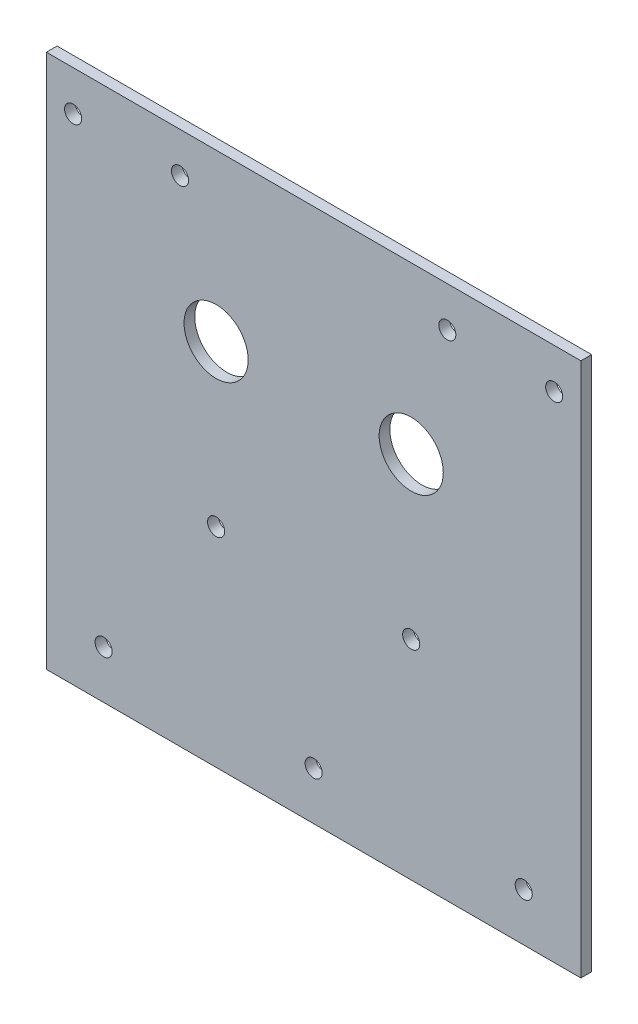
ISO-10303-21;
HEADER;
FILE_DESCRIPTION(('STEP AP214'),'2;1');
FILE_NAME('part.step','',(''),(''),'','','');
FILE_SCHEMA(('AUTOMOTIVE_DESIGN { 1 0 10303 214 1 1 1 1 }'));
ENDSEC;
DATA;
#1=APPLICATION_CONTEXT('core data for automotive mechanical design processes');
#2=APPLICATION_PROTOCOL_DEFINITION('international standard','automotive_design',2000,#1);
#3=PRODUCT_CONTEXT('',#1,'mechanical');
#4=PRODUCT('Part','Part','',(#3));
#5=PRODUCT_RELATED_PRODUCT_CATEGORY('part','',(#4));
#6=PRODUCT_DEFINITION_FORMATION('','',#4);
#7=PRODUCT_DEFINITION_CONTEXT('part definition',#1,'design');
#8=PRODUCT_DEFINITION('design','',#6,#7);
#9=PRODUCT_DEFINITION_SHAPE('','',#8);
#10=(LENGTH_UNIT() NAMED_UNIT(*) SI_UNIT(.MILLI.,.METRE.));
#11=(NAMED_UNIT(*) PLANE_ANGLE_UNIT() SI_UNIT($,.RADIAN.));
#12=(NAMED_UNIT(*) SI_UNIT($,.STERADIAN.) SOLID_ANGLE_UNIT());
#13=UNCERTAINTY_MEASURE_WITH_UNIT(LENGTH_MEASURE(1.E-05),#10,'distance_accuracy_value','');
#14=(GEOMETRIC_REPRESENTATION_CONTEXT(3) GLOBAL_UNCERTAINTY_ASSIGNED_CONTEXT((#13)) GLOBAL_UNIT_ASSIGNED_CONTEXT((#10,
#11,#12)) REPRESENTATION_CONTEXT('',''));
#15=CARTESIAN_POINT('',(0.,0.,0.));
#16=DIRECTION('',(0.,0.,1.));
#17=DIRECTION('',(1.,0.,0.));
#18=AXIS2_PLACEMENT_3D('',#15,#16,#17);
#19=CARTESIAN_POINT('',(50.,50.,2.));
#20=DIRECTION('',(-1.,0.,0.));
#21=DIRECTION('',(0.,-1.,0.));
#22=AXIS2_PLACEMENT_3D('',#19,#20,#21);
#23=PLANE('',#22);
#24=DIRECTION('',(0.,1.,0.));
#25=VECTOR('',#24,1.);
#26=CARTESIAN_POINT('',(50.,50.,0.));
#27=LINE('',#26,#25);
#28=CARTESIAN_POINT('',(50.,-50.,0.));
#29=VERTEX_POINT('',#28);
#30=CARTESIAN_POINT('',(50.,50.,0.));
#31=VERTEX_POINT('',#30);
#32=EDGE_CURVE('E101',#29,#31,#27,.T.);
#33=ORIENTED_EDGE('',*,*,#32,.T.);
#34=DIRECTION('',(0.,0.,-1.));
#35=VECTOR('',#34,1.);
#36=CARTESIAN_POINT('',(50.,50.,2.));
#37=LINE('',#36,#35);
#38=CARTESIAN_POINT('',(50.,50.,2.));
#39=VERTEX_POINT('',#38);
#40=EDGE_CURVE('E11',#39,#31,#37,.T.);
#41=ORIENTED_EDGE('',*,*,#40,.F.);
#42=DIRECTION('',(0.,1.,0.));
#43=VECTOR('',#42,1.);
#44=CARTESIAN_POINT('',(50.,50.,2.));
#45=LINE('',#44,#43);
#46=CARTESIAN_POINT('',(50.,-50.,2.));
#47=VERTEX_POINT('',#46);
#48=EDGE_CURVE('E88',#47,#39,#45,.T.);
#49=ORIENTED_EDGE('',*,*,#48,.F.);
#50=DIRECTION('',(0.,0.,-1.));
#51=VECTOR('',#50,1.);
#52=CARTESIAN_POINT('',(50.,-50.,2.));
#53=LINE('',#52,#51);
#54=EDGE_CURVE('E97',#47,#29,#53,.T.);
#55=ORIENTED_EDGE('',*,*,#54,.T.);
#56=EDGE_LOOP('',(#33,#41,#49,#55));
#57=FACE_BOUND('',#56,.T.);
#58=ADVANCED_FACE('F35',(#57),#23,.F.);
#59=CARTESIAN_POINT('',(-50.,50.,2.));
#60=DIRECTION('',(0.,-1.,0.));
#61=DIRECTION('',(0.,0.,-1.));
#62=AXIS2_PLACEMENT_3D('',#59,#60,#61);
#63=PLANE('',#62);
#64=DIRECTION('',(-1.,0.,0.));
#65=VECTOR('',#64,1.);
#66=CARTESIAN_POINT('',(-50.,50.,0.));
#67=LINE('',#66,#65);
#68=CARTESIAN_POINT('',(-50.,50.,0.));
#69=VERTEX_POINT('',#68);
#70=EDGE_CURVE('E92',#31,#69,#67,.T.);
#71=ORIENTED_EDGE('',*,*,#70,.T.);
#72=DIRECTION('',(0.,0.,-1.));
#73=VECTOR('',#72,1.);
#74=CARTESIAN_POINT('',(-50.,50.,2.));
#75=LINE('',#74,#73);
#76=CARTESIAN_POINT('',(-50.,50.,2.));
#77=VERTEX_POINT('',#76);
#78=EDGE_CURVE('E44',#77,#69,#75,.T.);
#79=ORIENTED_EDGE('',*,*,#78,.F.);
#80=DIRECTION('',(-1.,0.,0.));
#81=VECTOR('',#80,1.);
#82=CARTESIAN_POINT('',(-50.,50.,2.));
#83=LINE('',#82,#81);
#84=EDGE_CURVE('E83',#39,#77,#83,.T.);
#85=ORIENTED_EDGE('',*,*,#84,.F.);
#86=ORIENTED_EDGE('',*,*,#40,.T.);
#87=EDGE_LOOP('',(#71,#79,#85,#86));
#88=FACE_BOUND('',#87,.T.);
#89=ADVANCED_FACE('F91',(#88),#63,.F.);
#90=CARTESIAN_POINT('',(-50.,50.,2.));
#91=DIRECTION('',(1.,0.,0.));
#92=DIRECTION('',(0.,1.,0.));
#93=AXIS2_PLACEMENT_3D('',#90,#91,#92);
#94=PLANE('',#93);
#95=DIRECTION('',(0.,-1.,0.));
#96=VECTOR('',#95,1.);
#97=CARTESIAN_POINT('',(-50.,50.,0.));
#98=LINE('',#97,#96);
#99=CARTESIAN_POINT('',(-50.,-50.,0.));
#100=VERTEX_POINT('',#99);
#101=EDGE_CURVE('E70',#69,#100,#98,.T.);
#102=ORIENTED_EDGE('',*,*,#101,.T.);
#103=DIRECTION('',(0.,0.,-1.));
#104=VECTOR('',#103,1.);
#105=CARTESIAN_POINT('',(-50.,-50.,2.));
#106=LINE('',#105,#104);
#107=CARTESIAN_POINT('',(-50.,-50.,2.));
#108=VERTEX_POINT('',#107);
#109=EDGE_CURVE('E93',#108,#100,#106,.T.);
#110=ORIENTED_EDGE('',*,*,#109,.F.);
#111=DIRECTION('',(0.,-1.,0.));
#112=VECTOR('',#111,1.);
#113=CARTESIAN_POINT('',(-50.,50.,2.));
#114=LINE('',#113,#112);
#115=EDGE_CURVE('E86',#77,#108,#114,.T.);
#116=ORIENTED_EDGE('',*,*,#115,.F.);
#117=ORIENTED_EDGE('',*,*,#78,.T.);
#118=EDGE_LOOP('',(#102,#110,#116,#117));
#119=FACE_BOUND('',#118,.T.);
#120=ADVANCED_FACE('F95',(#119),#94,.F.);
#121=CARTESIAN_POINT('',(-50.,-50.,2.));
#122=DIRECTION('',(0.,1.,0.));
#123=DIRECTION('',(0.,0.,1.));
#124=AXIS2_PLACEMENT_3D('',#121,#122,#123);
#125=PLANE('',#124);
#126=DIRECTION('',(1.,0.,0.));
#127=VECTOR('',#126,1.);
#128=CARTESIAN_POINT('',(-50.,-50.,0.));
#129=LINE('',#128,#127);
#130=EDGE_CURVE('E76',#100,#29,#129,.T.);
#131=ORIENTED_EDGE('',*,*,#130,.T.);
#132=ORIENTED_EDGE('',*,*,#54,.F.);
#133=DIRECTION('',(1.,0.,0.));
#134=VECTOR('',#133,1.);
#135=CARTESIAN_POINT('',(-50.,-50.,2.));
#136=LINE('',#135,#134);
#137=EDGE_CURVE('E53',#108,#47,#136,.T.);
#138=ORIENTED_EDGE('',*,*,#137,.F.);
#139=ORIENTED_EDGE('',*,*,#109,.T.);
#140=EDGE_LOOP('',(#131,#132,#138,#139));
#141=FACE_BOUND('',#140,.T.);
#142=ADVANCED_FACE('F182',(#141),#125,.F.);
#143=CARTESIAN_POINT('',(0.,0.,2.));
#144=DIRECTION('',(0.,0.,1.));
#145=DIRECTION('',(1.,0.,0.));
#146=AXIS2_PLACEMENT_3D('',#143,#144,#145);
#147=PLANE('',#146);
#148=CARTESIAN_POINT('',(-39.3,-41.,2.));
#149=DIRECTION('',(0.,0.,1.));
#150=DIRECTION('',(1.,0.,0.));
#151=AXIS2_PLACEMENT_3D('',#148,#149,#150);
#152=CIRCLE('',#151,1.6);
#153=CARTESIAN_POINT('',(-37.7,-41.,2.));
#154=VERTEX_POINT('',#153);
#155=EDGE_CURVE('E131',#154,#154,#152,.T.);
#156=ORIENTED_EDGE('',*,*,#155,.F.);
#157=EDGE_LOOP('',(#156));
#158=FACE_BOUND('',#157,.T.);
#159=CARTESIAN_POINT('',(39.3,-41.,2.));
#160=DIRECTION('',(0.,0.,1.));
#161=DIRECTION('',(1.,0.,0.));
#162=AXIS2_PLACEMENT_3D('',#159,#160,#161);
#163=CIRCLE('',#162,1.6);
#164=CARTESIAN_POINT('',(40.9,-41.,2.));
#165=VERTEX_POINT('',#164);
#166=EDGE_CURVE('E137',#165,#165,#163,.T.);
#167=ORIENTED_EDGE('',*,*,#166,.F.);
#168=EDGE_LOOP('',(#167));
#169=FACE_BOUND('',#168,.T.);
#170=CARTESIAN_POINT('',(-18.25,-11.,2.));
#171=DIRECTION('',(0.,0.,1.));
#172=DIRECTION('',(1.,0.,0.));
#173=AXIS2_PLACEMENT_3D('',#170,#171,#172);
#174=CIRCLE('',#173,1.6);
#175=CARTESIAN_POINT('',(-16.65,-11.,2.));
#176=VERTEX_POINT('',#175);
#177=EDGE_CURVE('E126',#176,#176,#174,.T.);
#178=ORIENTED_EDGE('',*,*,#177,.F.);
#179=EDGE_LOOP('',(#178));
#180=FACE_BOUND('',#179,.T.);
#181=CARTESIAN_POINT('',(18.25,-11.,2.));
#182=DIRECTION('',(0.,0.,1.));
#183=DIRECTION('',(1.,0.,0.));
#184=AXIS2_PLACEMENT_3D('',#181,#182,#183);
#185=CIRCLE('',#184,1.6);
#186=CARTESIAN_POINT('',(19.85,-11.,2.));
#187=VERTEX_POINT('',#186);
#188=EDGE_CURVE('E135',#187,#187,#185,.T.);
#189=ORIENTED_EDGE('',*,*,#188,.F.);
#190=EDGE_LOOP('',(#189));
#191=FACE_BOUND('',#190,.T.);
#192=CARTESIAN_POINT('',(-18.25,19.,2.));
#193=DIRECTION('',(0.,0.,1.));
#194=DIRECTION('',(1.,0.,0.));
#195=AXIS2_PLACEMENT_3D('',#192,#193,#194);
#196=CIRCLE('',#195,6.);
#197=CARTESIAN_POINT('',(-12.25,19.,2.));
#198=VERTEX_POINT('',#197);
#199=EDGE_CURVE('E119',#198,#198,#196,.T.);
#200=ORIENTED_EDGE('',*,*,#199,.F.);
#201=EDGE_LOOP('',(#200));
#202=FACE_BOUND('',#201,.T.);
#203=CARTESIAN_POINT('',(18.25,19.,2.));
#204=DIRECTION('',(0.,0.,1.));
#205=DIRECTION('',(1.,0.,0.));
#206=AXIS2_PLACEMENT_3D('',#203,#204,#205);
#207=CIRCLE('',#206,6.);
#208=CARTESIAN_POINT('',(24.25,19.,2.));
#209=VERTEX_POINT('',#208);
#210=EDGE_CURVE('E128',#209,#209,#207,.T.);
#211=ORIENTED_EDGE('',*,*,#210,.F.);
#212=EDGE_LOOP('',(#211));
#213=FACE_BOUND('',#212,.T.);
#214=CARTESIAN_POINT('',(0.,-41.,2.));
#215=DIRECTION('',(0.,0.,1.));
#216=DIRECTION('',(1.,0.,0.));
#217=AXIS2_PLACEMENT_3D('',#214,#215,#216);
#218=CIRCLE('',#217,1.6);
#219=CARTESIAN_POINT('',(1.6,-41.,2.));
#220=VERTEX_POINT('',#219);
#221=EDGE_CURVE('E114',#220,#220,#218,.T.);
#222=ORIENTED_EDGE('',*,*,#221,.F.);
#223=EDGE_LOOP('',(#222));
#224=FACE_BOUND('',#223,.T.);
#225=CARTESIAN_POINT('',(-45.,42.5,2.));
#226=DIRECTION('',(0.,0.,1.));
#227=DIRECTION('',(1.,0.,0.));
#228=AXIS2_PLACEMENT_3D('',#225,#226,#227);
#229=CIRCLE('',#228,1.6);
#230=CARTESIAN_POINT('',(-43.4,42.5,2.));
#231=VERTEX_POINT('',#230);
#232=EDGE_CURVE('E156',#231,#231,#229,.T.);
#233=ORIENTED_EDGE('',*,*,#232,.F.);
#234=EDGE_LOOP('',(#233));
#235=FACE_BOUND('',#234,.T.);
#236=CARTESIAN_POINT('',(25.,42.5,2.));
#237=DIRECTION('',(0.,0.,1.));
#238=DIRECTION('',(1.,0.,0.));
#239=AXIS2_PLACEMENT_3D('',#236,#237,#238);
#240=CIRCLE('',#239,1.6);
#241=CARTESIAN_POINT('',(26.6,42.5,2.));
#242=VERTEX_POINT('',#241);
#243=EDGE_CURVE('E113',#242,#242,#240,.T.);
#244=ORIENTED_EDGE('',*,*,#243,.F.);
#245=EDGE_LOOP('',(#244));
#246=FACE_BOUND('',#245,.T.);
#247=CARTESIAN_POINT('',(45.,42.5,2.));
#248=DIRECTION('',(0.,0.,1.));
#249=DIRECTION('',(1.,0.,0.));
#250=AXIS2_PLACEMENT_3D('',#247,#248,#249);
#251=CIRCLE('',#250,1.6);
#252=CARTESIAN_POINT('',(46.6,42.5,2.));
#253=VERTEX_POINT('',#252);
#254=EDGE_CURVE('E163',#253,#253,#251,.T.);
#255=ORIENTED_EDGE('',*,*,#254,.F.);
#256=EDGE_LOOP('',(#255));
#257=FACE_BOUND('',#256,.T.);
#258=CARTESIAN_POINT('',(-25.,42.5,2.));
#259=DIRECTION('',(0.,0.,1.));
#260=DIRECTION('',(1.,0.,0.));
#261=AXIS2_PLACEMENT_3D('',#258,#259,#260);
#262=CIRCLE('',#261,1.6);
#263=CARTESIAN_POINT('',(-23.4,42.5,2.));
#264=VERTEX_POINT('',#263);
#265=EDGE_CURVE('E168',#264,#264,#262,.T.);
#266=ORIENTED_EDGE('',*,*,#265,.F.);
#267=EDGE_LOOP('',(#266));
#268=FACE_BOUND('',#267,.T.);
#269=ORIENTED_EDGE('',*,*,#48,.T.);
#270=ORIENTED_EDGE('',*,*,#84,.T.);
#271=ORIENTED_EDGE('',*,*,#115,.T.);
#272=ORIENTED_EDGE('',*,*,#137,.T.);
#273=EDGE_LOOP('',(#269,#270,#271,#272));
#274=FACE_BOUND('',#273,.T.);
#275=ADVANCED_FACE('F84',(#158,#169,#180,#191,#202,#213,#224,#235,#246,#257,#268,#274),#147,.T.);
#276=CARTESIAN_POINT('',(0.,0.,0.));
#277=DIRECTION('',(0.,0.,1.));
#278=DIRECTION('',(1.,0.,0.));
#279=AXIS2_PLACEMENT_3D('',#276,#277,#278);
#280=PLANE('',#279);
#281=CARTESIAN_POINT('',(-39.3,-41.,0.));
#282=DIRECTION('',(0.,0.,1.));
#283=DIRECTION('',(1.,0.,0.));
#284=AXIS2_PLACEMENT_3D('',#281,#282,#283);
#285=CIRCLE('',#284,1.6);
#286=CARTESIAN_POINT('',(-37.7,-41.,0.));
#287=VERTEX_POINT('',#286);
#288=EDGE_CURVE('E38',#287,#287,#285,.T.);
#289=ORIENTED_EDGE('',*,*,#288,.T.);
#290=EDGE_LOOP('',(#289));
#291=FACE_BOUND('',#290,.T.);
#292=CARTESIAN_POINT('',(39.3,-41.,0.));
#293=DIRECTION('',(0.,0.,1.));
#294=DIRECTION('',(1.,0.,0.));
#295=AXIS2_PLACEMENT_3D('',#292,#293,#294);
#296=CIRCLE('',#295,1.6);
#297=CARTESIAN_POINT('',(40.9,-41.,0.));
#298=VERTEX_POINT('',#297);
#299=EDGE_CURVE('E129',#298,#298,#296,.T.);
#300=ORIENTED_EDGE('',*,*,#299,.T.);
#301=EDGE_LOOP('',(#300));
#302=FACE_BOUND('',#301,.T.);
#303=CARTESIAN_POINT('',(-18.25,-11.,0.));
#304=DIRECTION('',(0.,0.,1.));
#305=DIRECTION('',(1.,0.,0.));
#306=AXIS2_PLACEMENT_3D('',#303,#304,#305);
#307=CIRCLE('',#306,1.6);
#308=CARTESIAN_POINT('',(-16.65,-11.,0.));
#309=VERTEX_POINT('',#308);
#310=EDGE_CURVE('E125',#309,#309,#307,.T.);
#311=ORIENTED_EDGE('',*,*,#310,.T.);
#312=EDGE_LOOP('',(#311));
#313=FACE_BOUND('',#312,.T.);
#314=CARTESIAN_POINT('',(18.25,-11.,0.));
#315=DIRECTION('',(0.,0.,1.));
#316=DIRECTION('',(1.,0.,0.));
#317=AXIS2_PLACEMENT_3D('',#314,#315,#316);
#318=CIRCLE('',#317,1.6);
#319=CARTESIAN_POINT('',(19.85,-11.,0.));
#320=VERTEX_POINT('',#319);
#321=EDGE_CURVE('E122',#320,#320,#318,.T.);
#322=ORIENTED_EDGE('',*,*,#321,.T.);
#323=EDGE_LOOP('',(#322));
#324=FACE_BOUND('',#323,.T.);
#325=CARTESIAN_POINT('',(-18.25,19.,0.));
#326=DIRECTION('',(0.,0.,1.));
#327=DIRECTION('',(1.,0.,0.));
#328=AXIS2_PLACEMENT_3D('',#325,#326,#327);
#329=CIRCLE('',#328,6.);
#330=CARTESIAN_POINT('',(-12.25,19.,0.));
#331=VERTEX_POINT('',#330);
#332=EDGE_CURVE('E118',#331,#331,#329,.T.);
#333=ORIENTED_EDGE('',*,*,#332,.T.);
#334=EDGE_LOOP('',(#333));
#335=FACE_BOUND('',#334,.T.);
#336=CARTESIAN_POINT('',(18.25,19.,0.));
#337=DIRECTION('',(0.,0.,1.));
#338=DIRECTION('',(1.,0.,0.));
#339=AXIS2_PLACEMENT_3D('',#336,#337,#338);
#340=CIRCLE('',#339,6.);
#341=CARTESIAN_POINT('',(24.25,19.,0.));
#342=VERTEX_POINT('',#341);
#343=EDGE_CURVE('E115',#342,#342,#340,.T.);
#344=ORIENTED_EDGE('',*,*,#343,.T.);
#345=EDGE_LOOP('',(#344));
#346=FACE_BOUND('',#345,.T.);
#347=CARTESIAN_POINT('',(0.,-41.,0.));
#348=DIRECTION('',(0.,0.,1.));
#349=DIRECTION('',(1.,0.,0.));
#350=AXIS2_PLACEMENT_3D('',#347,#348,#349);
#351=CIRCLE('',#350,1.6);
#352=CARTESIAN_POINT('',(1.6,-41.,0.));
#353=VERTEX_POINT('',#352);
#354=EDGE_CURVE('E110',#353,#353,#351,.T.);
#355=ORIENTED_EDGE('',*,*,#354,.T.);
#356=EDGE_LOOP('',(#355));
#357=FACE_BOUND('',#356,.T.);
#358=CARTESIAN_POINT('',(-45.,42.5,0.));
#359=DIRECTION('',(0.,0.,1.));
#360=DIRECTION('',(1.,0.,0.));
#361=AXIS2_PLACEMENT_3D('',#358,#359,#360);
#362=CIRCLE('',#361,1.6);
#363=CARTESIAN_POINT('',(-43.4,42.5,0.));
#364=VERTEX_POINT('',#363);
#365=EDGE_CURVE('E104',#364,#364,#362,.T.);
#366=ORIENTED_EDGE('',*,*,#365,.T.);
#367=EDGE_LOOP('',(#366));
#368=FACE_BOUND('',#367,.T.);
#369=CARTESIAN_POINT('',(25.,42.5,0.));
#370=DIRECTION('',(0.,0.,1.));
#371=DIRECTION('',(1.,0.,0.));
#372=AXIS2_PLACEMENT_3D('',#369,#370,#371);
#373=CIRCLE('',#372,1.6);
#374=CARTESIAN_POINT('',(26.6,42.5,0.));
#375=VERTEX_POINT('',#374);
#376=EDGE_CURVE('E160',#375,#375,#373,.T.);
#377=ORIENTED_EDGE('',*,*,#376,.T.);
#378=EDGE_LOOP('',(#377));
#379=FACE_BOUND('',#378,.T.);
#380=CARTESIAN_POINT('',(45.,42.5,0.));
#381=DIRECTION('',(0.,0.,1.));
#382=DIRECTION('',(1.,0.,0.));
#383=AXIS2_PLACEMENT_3D('',#380,#381,#382);
#384=CIRCLE('',#383,1.6);
#385=CARTESIAN_POINT('',(46.6,42.5,0.));
#386=VERTEX_POINT('',#385);
#387=EDGE_CURVE('E171',#386,#386,#384,.T.);
#388=ORIENTED_EDGE('',*,*,#387,.T.);
#389=EDGE_LOOP('',(#388));
#390=FACE_BOUND('',#389,.T.);
#391=CARTESIAN_POINT('',(-25.,42.5,0.));
#392=DIRECTION('',(0.,0.,1.));
#393=DIRECTION('',(1.,0.,0.));
#394=AXIS2_PLACEMENT_3D('',#391,#392,#393);
#395=CIRCLE('',#394,1.6);
#396=CARTESIAN_POINT('',(-23.4,42.5,0.));
#397=VERTEX_POINT('',#396);
#398=EDGE_CURVE('E159',#397,#397,#395,.T.);
#399=ORIENTED_EDGE('',*,*,#398,.T.);
#400=EDGE_LOOP('',(#399));
#401=FACE_BOUND('',#400,.T.);
#402=ORIENTED_EDGE('',*,*,#32,.F.);
#403=ORIENTED_EDGE('',*,*,#130,.F.);
#404=ORIENTED_EDGE('',*,*,#101,.F.);
#405=ORIENTED_EDGE('',*,*,#70,.F.);
#406=EDGE_LOOP('',(#402,#403,#404,#405));
#407=FACE_BOUND('',#406,.T.);
#408=ADVANCED_FACE('F181',(#291,#302,#313,#324,#335,#346,#357,#368,#379,#390,#401,#407),#280,.F.);
#409=CARTESIAN_POINT('',(-25.,42.5,0.));
#410=DIRECTION('',(0.,0.,1.));
#411=DIRECTION('',(1.,0.,0.));
#412=AXIS2_PLACEMENT_3D('',#409,#410,#411);
#413=CYLINDRICAL_SURFACE('',#412,1.6);
#414=ORIENTED_EDGE('',*,*,#398,.F.);
#415=EDGE_LOOP('',(#414));
#416=FACE_BOUND('',#415,.T.);
#417=ORIENTED_EDGE('',*,*,#265,.T.);
#418=EDGE_LOOP('',(#417));
#419=FACE_BOUND('',#418,.T.);
#420=ADVANCED_FACE('F187',(#416,#419),#413,.F.);
#421=CARTESIAN_POINT('',(45.,42.5,0.));
#422=DIRECTION('',(0.,0.,1.));
#423=DIRECTION('',(1.,0.,0.));
#424=AXIS2_PLACEMENT_3D('',#421,#422,#423);
#425=CYLINDRICAL_SURFACE('',#424,1.6);
#426=ORIENTED_EDGE('',*,*,#387,.F.);
#427=EDGE_LOOP('',(#426));
#428=FACE_BOUND('',#427,.T.);
#429=ORIENTED_EDGE('',*,*,#254,.T.);
#430=EDGE_LOOP('',(#429));
#431=FACE_BOUND('',#430,.T.);
#432=ADVANCED_FACE('F177',(#428,#431),#425,.F.);
#433=CARTESIAN_POINT('',(25.,42.5,0.));
#434=DIRECTION('',(0.,0.,1.));
#435=DIRECTION('',(1.,0.,0.));
#436=AXIS2_PLACEMENT_3D('',#433,#434,#435);
#437=CYLINDRICAL_SURFACE('',#436,1.6);
#438=ORIENTED_EDGE('',*,*,#376,.F.);
#439=EDGE_LOOP('',(#438));
#440=FACE_BOUND('',#439,.T.);
#441=ORIENTED_EDGE('',*,*,#243,.T.);
#442=EDGE_LOOP('',(#441));
#443=FACE_BOUND('',#442,.T.);
#444=ADVANCED_FACE('F195',(#440,#443),#437,.F.);
#445=CARTESIAN_POINT('',(-45.,42.5,0.));
#446=DIRECTION('',(0.,0.,1.));
#447=DIRECTION('',(1.,0.,0.));
#448=AXIS2_PLACEMENT_3D('',#445,#446,#447);
#449=CYLINDRICAL_SURFACE('',#448,1.6);
#450=ORIENTED_EDGE('',*,*,#365,.F.);
#451=EDGE_LOOP('',(#450));
#452=FACE_BOUND('',#451,.T.);
#453=ORIENTED_EDGE('',*,*,#232,.T.);
#454=EDGE_LOOP('',(#453));
#455=FACE_BOUND('',#454,.T.);
#456=ADVANCED_FACE('F262',(#452,#455),#449,.F.);
#457=CARTESIAN_POINT('',(0.,-41.,-8.));
#458=DIRECTION('',(0.,0.,1.));
#459=DIRECTION('',(1.,0.,0.));
#460=AXIS2_PLACEMENT_3D('',#457,#458,#459);
#461=CYLINDRICAL_SURFACE('',#460,1.6);
#462=ORIENTED_EDGE('',*,*,#221,.T.);
#463=EDGE_LOOP('',(#462));
#464=FACE_BOUND('',#463,.T.);
#465=ORIENTED_EDGE('',*,*,#354,.F.);
#466=EDGE_LOOP('',(#465));
#467=FACE_BOUND('',#466,.T.);
#468=ADVANCED_FACE('F270',(#464,#467),#461,.F.);
#469=CARTESIAN_POINT('',(18.25,19.,-36.65));
#470=DIRECTION('',(0.,0.,1.));
#471=DIRECTION('',(1.,0.,0.));
#472=AXIS2_PLACEMENT_3D('',#469,#470,#471);
#473=CYLINDRICAL_SURFACE('',#472,6.);
#474=ORIENTED_EDGE('',*,*,#210,.T.);
#475=EDGE_LOOP('',(#474));
#476=FACE_BOUND('',#475,.T.);
#477=ORIENTED_EDGE('',*,*,#343,.F.);
#478=EDGE_LOOP('',(#477));
#479=FACE_BOUND('',#478,.T.);
#480=ADVANCED_FACE('F279',(#476,#479),#473,.F.);
#481=CARTESIAN_POINT('',(-18.25,19.,-36.65));
#482=DIRECTION('',(0.,0.,1.));
#483=DIRECTION('',(1.,0.,0.));
#484=AXIS2_PLACEMENT_3D('',#481,#482,#483);
#485=CYLINDRICAL_SURFACE('',#484,6.);
#486=ORIENTED_EDGE('',*,*,#199,.T.);
#487=EDGE_LOOP('',(#486));
#488=FACE_BOUND('',#487,.T.);
#489=ORIENTED_EDGE('',*,*,#332,.F.);
#490=EDGE_LOOP('',(#489));
#491=FACE_BOUND('',#490,.T.);
#492=ADVANCED_FACE('F288',(#488,#491),#485,.F.);
#493=CARTESIAN_POINT('',(18.25,-11.,-36.6));
#494=DIRECTION('',(0.,0.,1.));
#495=DIRECTION('',(1.,0.,0.));
#496=AXIS2_PLACEMENT_3D('',#493,#494,#495);
#497=CYLINDRICAL_SURFACE('',#496,1.6);
#498=ORIENTED_EDGE('',*,*,#188,.T.);
#499=EDGE_LOOP('',(#498));
#500=FACE_BOUND('',#499,.T.);
#501=ORIENTED_EDGE('',*,*,#321,.F.);
#502=EDGE_LOOP('',(#501));
#503=FACE_BOUND('',#502,.T.);
#504=ADVANCED_FACE('F297',(#500,#503),#497,.F.);
#505=CARTESIAN_POINT('',(-18.25,-11.,-36.6));
#506=DIRECTION('',(0.,0.,1.));
#507=DIRECTION('',(1.,0.,0.));
#508=AXIS2_PLACEMENT_3D('',#505,#506,#507);
#509=CYLINDRICAL_SURFACE('',#508,1.6);
#510=ORIENTED_EDGE('',*,*,#177,.T.);
#511=EDGE_LOOP('',(#510));
#512=FACE_BOUND('',#511,.T.);
#513=ORIENTED_EDGE('',*,*,#310,.F.);
#514=EDGE_LOOP('',(#513));
#515=FACE_BOUND('',#514,.T.);
#516=ADVANCED_FACE('F306',(#512,#515),#509,.F.);
#517=CARTESIAN_POINT('',(39.3,-41.,-8.));
#518=DIRECTION('',(0.,0.,1.));
#519=DIRECTION('',(1.,0.,0.));
#520=AXIS2_PLACEMENT_3D('',#517,#518,#519);
#521=CYLINDRICAL_SURFACE('',#520,1.6);
#522=ORIENTED_EDGE('',*,*,#166,.T.);
#523=EDGE_LOOP('',(#522));
#524=FACE_BOUND('',#523,.T.);
#525=ORIENTED_EDGE('',*,*,#299,.F.);
#526=EDGE_LOOP('',(#525));
#527=FACE_BOUND('',#526,.T.);
#528=ADVANCED_FACE('F315',(#524,#527),#521,.F.);
#529=CARTESIAN_POINT('',(-39.3,-41.,-8.));
#530=DIRECTION('',(0.,0.,1.));
#531=DIRECTION('',(1.,0.,0.));
#532=AXIS2_PLACEMENT_3D('',#529,#530,#531);
#533=CYLINDRICAL_SURFACE('',#532,1.6);
#534=ORIENTED_EDGE('',*,*,#155,.T.);
#535=EDGE_LOOP('',(#534));
#536=FACE_BOUND('',#535,.T.);
#537=ORIENTED_EDGE('',*,*,#288,.F.);
#538=EDGE_LOOP('',(#537));
#539=FACE_BOUND('',#538,.T.);
#540=ADVANCED_FACE('F324',(#536,#539),#533,.F.);
#541=CLOSED_SHELL('',(#58,#89,#120,#142,#275,#408,#420,#432,#444,#456,#468,#480,#492,#504,#516,
#528,#540));
#542=MANIFOLD_SOLID_BREP('B2',#541);
#543=ADVANCED_BREP_SHAPE_REPRESENTATION('',(#18,#542),#14);
#544=SHAPE_DEFINITION_REPRESENTATION(#9,#543);
ENDSEC;
END-ISO-10303-21;
